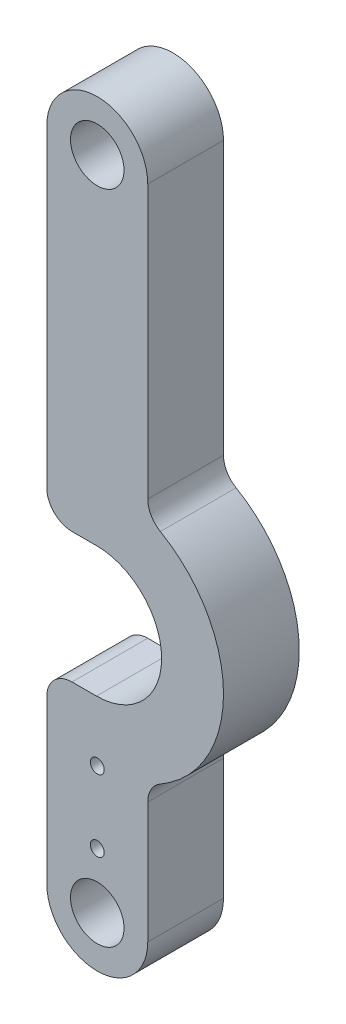
ISO-10303-21;
HEADER;
FILE_DESCRIPTION(('STEP AP214'),'2;1');
FILE_NAME('part.step','',(''),(''),'','','');
FILE_SCHEMA(('AUTOMOTIVE_DESIGN { 1 0 10303 214 1 1 1 1 }'));
ENDSEC;
DATA;
#1=APPLICATION_CONTEXT('core data for automotive mechanical design processes');
#2=APPLICATION_PROTOCOL_DEFINITION('international standard','automotive_design',2000,#1);
#3=PRODUCT_CONTEXT('',#1,'mechanical');
#4=PRODUCT('Part','Part','',(#3));
#5=PRODUCT_RELATED_PRODUCT_CATEGORY('part','',(#4));
#6=PRODUCT_DEFINITION_FORMATION('','',#4);
#7=PRODUCT_DEFINITION_CONTEXT('part definition',#1,'design');
#8=PRODUCT_DEFINITION('design','',#6,#7);
#9=PRODUCT_DEFINITION_SHAPE('','',#8);
#10=(LENGTH_UNIT() NAMED_UNIT(*) SI_UNIT(.MILLI.,.METRE.));
#11=(NAMED_UNIT(*) PLANE_ANGLE_UNIT() SI_UNIT($,.RADIAN.));
#12=(NAMED_UNIT(*) SI_UNIT($,.STERADIAN.) SOLID_ANGLE_UNIT());
#13=UNCERTAINTY_MEASURE_WITH_UNIT(LENGTH_MEASURE(1.E-05),#10,'distance_accuracy_value','');
#14=(GEOMETRIC_REPRESENTATION_CONTEXT(3) GLOBAL_UNCERTAINTY_ASSIGNED_CONTEXT((#13)) GLOBAL_UNIT_ASSIGNED_CONTEXT((#10,
#11,#12)) REPRESENTATION_CONTEXT('',''));
#15=CARTESIAN_POINT('',(0.,0.,0.));
#16=DIRECTION('',(0.,0.,1.));
#17=DIRECTION('',(1.,0.,0.));
#18=AXIS2_PLACEMENT_3D('',#15,#16,#17);
#19=CARTESIAN_POINT('',(-6.35,0.,9.525));
#20=DIRECTION('',(1.,0.,0.));
#21=DIRECTION('',(0.,0.,-1.));
#22=AXIS2_PLACEMENT_3D('',#19,#20,#21);
#23=PLANE('',#22);
#24=DIRECTION('',(0.,-1.,0.));
#25=VECTOR('',#24,1.);
#26=CARTESIAN_POINT('',(-6.35,0.,9.525));
#27=LINE('',#26,#25);
#28=CARTESIAN_POINT('',(-6.35,20.3835,9.525));
#29=VERTEX_POINT('',#28);
#30=CARTESIAN_POINT('',(-6.35,0.,9.525));
#31=VERTEX_POINT('',#30);
#32=EDGE_CURVE('E214',#29,#31,#27,.T.);
#33=ORIENTED_EDGE('',*,*,#32,.F.);
#34=DIRECTION('',(0.,0.,1.));
#35=VECTOR('',#34,1.);
#36=CARTESIAN_POINT('',(-6.35,20.3835,9.525));
#37=LINE('',#36,#35);
#38=CARTESIAN_POINT('',(-6.35,20.3835,0.));
#39=VERTEX_POINT('',#38);
#40=EDGE_CURVE('E247',#29,#39,#37,.F.);
#41=ORIENTED_EDGE('',*,*,#40,.T.);
#42=DIRECTION('',(0.,-1.,0.));
#43=VECTOR('',#42,1.);
#44=CARTESIAN_POINT('',(-6.35,0.,0.));
#45=LINE('',#44,#43);
#46=CARTESIAN_POINT('',(-6.35,0.,0.));
#47=VERTEX_POINT('',#46);
#48=EDGE_CURVE('E226',#39,#47,#45,.T.);
#49=ORIENTED_EDGE('',*,*,#48,.T.);
#50=DIRECTION('',(0.,0.,-1.));
#51=VECTOR('',#50,1.);
#52=CARTESIAN_POINT('',(-6.35,0.,9.525));
#53=LINE('',#52,#51);
#54=EDGE_CURVE('E218',#31,#47,#53,.T.);
#55=ORIENTED_EDGE('',*,*,#54,.F.);
#56=EDGE_LOOP('',(#33,#41,#49,#55));
#57=FACE_BOUND('',#56,.T.);
#58=ADVANCED_FACE('F39',(#57),#23,.F.);
#59=CARTESIAN_POINT('',(6.35,0.,9.525));
#60=DIRECTION('',(-1.,0.,0.));
#61=DIRECTION('',(0.,0.,1.));
#62=AXIS2_PLACEMENT_3D('',#59,#60,#61);
#63=PLANE('',#62);
#64=DIRECTION('',(0.,1.,0.));
#65=VECTOR('',#64,1.);
#66=CARTESIAN_POINT('',(6.35,0.,0.));
#67=LINE('',#66,#65);
#68=CARTESIAN_POINT('',(6.35,0.,0.));
#69=VERTEX_POINT('',#68);
#70=CARTESIAN_POINT('',(6.35,15.2522160579064,0.));
#71=VERTEX_POINT('',#70);
#72=EDGE_CURVE('E222',#69,#71,#67,.T.);
#73=ORIENTED_EDGE('',*,*,#72,.T.);
#74=DIRECTION('',(0.,0.,1.));
#75=VECTOR('',#74,1.);
#76=CARTESIAN_POINT('',(6.35,15.2522160579064,9.525));
#77=LINE('',#76,#75);
#78=CARTESIAN_POINT('',(6.35,15.2522160579064,9.525));
#79=VERTEX_POINT('',#78);
#80=EDGE_CURVE('E264',#71,#79,#77,.T.);
#81=ORIENTED_EDGE('',*,*,#80,.T.);
#82=DIRECTION('',(0.,1.,0.));
#83=VECTOR('',#82,1.);
#84=CARTESIAN_POINT('',(6.35,0.,9.525));
#85=LINE('',#84,#83);
#86=CARTESIAN_POINT('',(6.35,0.,9.525));
#87=VERTEX_POINT('',#86);
#88=EDGE_CURVE('E209',#87,#79,#85,.T.);
#89=ORIENTED_EDGE('',*,*,#88,.F.);
#90=DIRECTION('',(0.,0.,-1.));
#91=VECTOR('',#90,1.);
#92=CARTESIAN_POINT('',(6.35,0.,9.525));
#93=LINE('',#92,#91);
#94=EDGE_CURVE('E237',#87,#69,#93,.T.);
#95=ORIENTED_EDGE('',*,*,#94,.T.);
#96=EDGE_LOOP('',(#73,#81,#89,#95));
#97=FACE_BOUND('',#96,.T.);
#98=ADVANCED_FACE('F279',(#97),#63,.F.);
#99=CARTESIAN_POINT('',(0.,0.,9.525));
#100=DIRECTION('',(0.,0.,1.));
#101=DIRECTION('',(1.,0.,0.));
#102=AXIS2_PLACEMENT_3D('',#99,#100,#101);
#103=PLANE('',#102);
#104=DIRECTION('',(1.,0.,0.));
#105=VECTOR('',#104,1.);
#106=CARTESIAN_POINT('',(-0.0968086729051788,23.5585,9.525));
#107=LINE('',#106,#105);
#108=CARTESIAN_POINT('',(-3.175,23.5585,9.525));
#109=VERTEX_POINT('',#108);
#110=CARTESIAN_POINT('',(-0.0968086729051788,23.5585,9.525));
#111=VERTEX_POINT('',#110);
#112=EDGE_CURVE('E165',#109,#111,#107,.T.);
#113=ORIENTED_EDGE('',*,*,#112,.F.);
#114=CARTESIAN_POINT('',(-3.175,20.3835,9.525));
#115=DIRECTION('',(0.,0.,1.));
#116=DIRECTION('',(1.,0.,0.));
#117=AXIS2_PLACEMENT_3D('',#114,#115,#116);
#118=CIRCLE('',#117,3.175);
#119=EDGE_CURVE('E245',#109,#29,#118,.T.);
#120=ORIENTED_EDGE('',*,*,#119,.T.);
#121=ORIENTED_EDGE('',*,*,#32,.T.);
#122=CARTESIAN_POINT('',(0.,0.,9.525));
#123=DIRECTION('',(0.,0.,1.));
#124=DIRECTION('',(1.,0.,0.));
#125=AXIS2_PLACEMENT_3D('',#122,#123,#124);
#126=CIRCLE('',#125,6.35);
#127=EDGE_CURVE('E204',#31,#87,#126,.T.);
#128=ORIENTED_EDGE('',*,*,#127,.T.);
#129=ORIENTED_EDGE('',*,*,#88,.T.);
#130=CARTESIAN_POINT('',(9.525,15.2522160579064,9.525));
#131=DIRECTION('',(0.,0.,1.));
#132=DIRECTION('',(1.,0.,0.));
#133=AXIS2_PLACEMENT_3D('',#130,#131,#132);
#134=CIRCLE('',#133,3.175);
#135=CARTESIAN_POINT('',(7.9375,18.001846714922,9.525));
#136=VERTEX_POINT('',#135);
#137=EDGE_CURVE('E47',#79,#136,#134,.F.);
#138=ORIENTED_EDGE('',*,*,#137,.T.);
#139=CARTESIAN_POINT('',(0.,31.75,9.525));
#140=DIRECTION('',(0.,0.,1.));
#141=DIRECTION('',(-1.,0.,0.));
#142=AXIS2_PLACEMENT_3D('',#139,#140,#141);
#143=CIRCLE('',#142,15.875);
#144=CARTESIAN_POINT('',(7.9375,45.498153285078,9.525));
#145=VERTEX_POINT('',#144);
#146=EDGE_CURVE('E173',#136,#145,#143,.T.);
#147=ORIENTED_EDGE('',*,*,#146,.T.);
#148=CARTESIAN_POINT('',(9.525,48.2477839420936,9.525));
#149=DIRECTION('',(0.,0.,1.));
#150=DIRECTION('',(1.,0.,0.));
#151=AXIS2_PLACEMENT_3D('',#148,#149,#150);
#152=CIRCLE('',#151,3.175);
#153=CARTESIAN_POINT('',(6.35,48.2477839420936,9.525));
#154=VERTEX_POINT('',#153);
#155=EDGE_CURVE('E266',#145,#154,#152,.F.);
#156=ORIENTED_EDGE('',*,*,#155,.T.);
#157=CARTESIAN_POINT('',(6.35,82.55,9.525));
#158=VERTEX_POINT('',#157);
#159=EDGE_CURVE('E207',#154,#158,#85,.T.);
#160=ORIENTED_EDGE('',*,*,#159,.T.);
#161=CARTESIAN_POINT('',(0.,82.55,9.525));
#162=DIRECTION('',(0.,0.,1.));
#163=DIRECTION('',(1.,0.,0.));
#164=AXIS2_PLACEMENT_3D('',#161,#162,#163);
#165=CIRCLE('',#164,6.35);
#166=CARTESIAN_POINT('',(-6.35,82.55,9.525));
#167=VERTEX_POINT('',#166);
#168=EDGE_CURVE('E212',#158,#167,#165,.T.);
#169=ORIENTED_EDGE('',*,*,#168,.T.);
#170=CARTESIAN_POINT('',(-6.35,43.1165,9.525));
#171=VERTEX_POINT('',#170);
#172=EDGE_CURVE('E215',#167,#171,#27,.T.);
#173=ORIENTED_EDGE('',*,*,#172,.T.);
#174=CARTESIAN_POINT('',(-3.175,43.1165,9.525));
#175=DIRECTION('',(0.,0.,1.));
#176=DIRECTION('',(1.,0.,0.));
#177=AXIS2_PLACEMENT_3D('',#174,#175,#176);
#178=CIRCLE('',#177,3.175);
#179=CARTESIAN_POINT('',(-3.175,39.9415,9.525));
#180=VERTEX_POINT('',#179);
#181=EDGE_CURVE('E243',#171,#180,#178,.T.);
#182=ORIENTED_EDGE('',*,*,#181,.T.);
#183=DIRECTION('',(-1.,0.,0.));
#184=VECTOR('',#183,1.);
#185=CARTESIAN_POINT('',(-0.0968086729051808,39.9415,9.525));
#186=LINE('',#185,#184);
#187=CARTESIAN_POINT('',(-0.0968086729051808,39.9415,9.525));
#188=VERTEX_POINT('',#187);
#189=EDGE_CURVE('E167',#188,#180,#186,.T.);
#190=ORIENTED_EDGE('',*,*,#189,.F.);
#191=CARTESIAN_POINT('',(-0.0968086729051798,31.75,9.525));
#192=DIRECTION('',(0.,0.,1.));
#193=DIRECTION('',(1.,0.,0.));
#194=AXIS2_PLACEMENT_3D('',#191,#192,#193);
#195=CIRCLE('',#194,8.19149999999999);
#196=EDGE_CURVE('E146',#111,#188,#195,.T.);
#197=ORIENTED_EDGE('',*,*,#196,.F.);
#198=EDGE_LOOP('',(#113,#120,#121,#128,#129,#138,#147,#156,#160,#169,#173,#182,#190,#197));
#199=FACE_BOUND('',#198,.T.);
#200=CARTESIAN_POINT('',(0.,6.99999997,9.525));
#201=DIRECTION('',(0.,0.,1.));
#202=DIRECTION('',(1.,0.,0.));
#203=AXIS2_PLACEMENT_3D('',#200,#201,#202);
#204=CIRCLE('',#203,0.877000024);
#205=CARTESIAN_POINT('',(0.877000024,6.99999997,9.525));
#206=VERTEX_POINT('',#205);
#207=EDGE_CURVE('E184',#206,#206,#204,.T.);
#208=ORIENTED_EDGE('',*,*,#207,.F.);
#209=EDGE_LOOP('',(#208));
#210=FACE_BOUND('',#209,.T.);
#211=CARTESIAN_POINT('',(0.,16.000000004,9.525));
#212=DIRECTION('',(0.,0.,1.));
#213=DIRECTION('',(1.,0.,0.));
#214=AXIS2_PLACEMENT_3D('',#211,#212,#213);
#215=CIRCLE('',#214,0.877000024);
#216=CARTESIAN_POINT('',(0.877000024,16.000000004,9.525));
#217=VERTEX_POINT('',#216);
#218=EDGE_CURVE('E187',#217,#217,#215,.T.);
#219=ORIENTED_EDGE('',*,*,#218,.F.);
#220=EDGE_LOOP('',(#219));
#221=FACE_BOUND('',#220,.T.);
#222=CARTESIAN_POINT('',(0.,82.55,9.525));
#223=DIRECTION('',(0.,0.,1.));
#224=DIRECTION('',(1.,0.,0.));
#225=AXIS2_PLACEMENT_3D('',#222,#223,#224);
#226=CIRCLE('',#225,3.36549999999999);
#227=CARTESIAN_POINT('',(-3.36549999999999,82.55,9.525));
#228=VERTEX_POINT('',#227);
#229=EDGE_CURVE('E198',#228,#228,#226,.T.);
#230=ORIENTED_EDGE('',*,*,#229,.F.);
#231=EDGE_LOOP('',(#230));
#232=FACE_BOUND('',#231,.T.);
#233=CARTESIAN_POINT('',(0.,0.,9.525));
#234=DIRECTION('',(0.,0.,1.));
#235=DIRECTION('',(1.,0.,0.));
#236=AXIS2_PLACEMENT_3D('',#233,#234,#235);
#237=CIRCLE('',#236,3.3655);
#238=CARTESIAN_POINT('',(-3.3655,0.,9.525));
#239=VERTEX_POINT('',#238);
#240=EDGE_CURVE('E192',#239,#239,#237,.T.);
#241=ORIENTED_EDGE('',*,*,#240,.F.);
#242=EDGE_LOOP('',(#241));
#243=FACE_BOUND('',#242,.T.);
#244=ADVANCED_FACE('F272',(#199,#210,#221,#232,#243),#103,.T.);
#245=CARTESIAN_POINT('',(0.,0.,0.));
#246=DIRECTION('',(0.,0.,1.));
#247=DIRECTION('',(1.,0.,0.));
#248=AXIS2_PLACEMENT_3D('',#245,#246,#247);
#249=PLANE('',#248);
#250=CARTESIAN_POINT('',(0.,6.99999997,0.));
#251=DIRECTION('',(0.,0.,1.));
#252=DIRECTION('',(1.,0.,0.));
#253=AXIS2_PLACEMENT_3D('',#250,#251,#252);
#254=CIRCLE('',#253,0.877000024);
#255=CARTESIAN_POINT('',(0.877000024,6.99999997,0.));
#256=VERTEX_POINT('',#255);
#257=EDGE_CURVE('E180',#256,#256,#254,.T.);
#258=ORIENTED_EDGE('',*,*,#257,.T.);
#259=EDGE_LOOP('',(#258));
#260=FACE_BOUND('',#259,.T.);
#261=CARTESIAN_POINT('',(0.,16.000000004,0.));
#262=DIRECTION('',(0.,0.,1.));
#263=DIRECTION('',(1.,0.,0.));
#264=AXIS2_PLACEMENT_3D('',#261,#262,#263);
#265=CIRCLE('',#264,0.877000024);
#266=CARTESIAN_POINT('',(0.877000024,16.000000004,0.));
#267=VERTEX_POINT('',#266);
#268=EDGE_CURVE('E177',#267,#267,#265,.T.);
#269=ORIENTED_EDGE('',*,*,#268,.T.);
#270=EDGE_LOOP('',(#269));
#271=FACE_BOUND('',#270,.T.);
#272=ORIENTED_EDGE('',*,*,#48,.F.);
#273=CARTESIAN_POINT('',(-3.175,20.3835,0.));
#274=DIRECTION('',(0.,0.,1.));
#275=DIRECTION('',(1.,0.,0.));
#276=AXIS2_PLACEMENT_3D('',#273,#274,#275);
#277=CIRCLE('',#276,3.175);
#278=CARTESIAN_POINT('',(-3.175,23.5585,0.));
#279=VERTEX_POINT('',#278);
#280=EDGE_CURVE('E251',#39,#279,#277,.F.);
#281=ORIENTED_EDGE('',*,*,#280,.T.);
#282=DIRECTION('',(1.,0.,0.));
#283=VECTOR('',#282,1.);
#284=CARTESIAN_POINT('',(-0.0968086729051788,23.5585,0.));
#285=LINE('',#284,#283);
#286=CARTESIAN_POINT('',(-0.0968086729051788,23.5585,0.));
#287=VERTEX_POINT('',#286);
#288=EDGE_CURVE('E151',#279,#287,#285,.T.);
#289=ORIENTED_EDGE('',*,*,#288,.T.);
#290=CARTESIAN_POINT('',(-0.0968086729051798,31.75,0.));
#291=DIRECTION('',(0.,0.,1.));
#292=DIRECTION('',(1.,0.,0.));
#293=AXIS2_PLACEMENT_3D('',#290,#291,#292);
#294=CIRCLE('',#293,8.19149999999999);
#295=CARTESIAN_POINT('',(-0.0968086729051808,39.9415,0.));
#296=VERTEX_POINT('',#295);
#297=EDGE_CURVE('E144',#287,#296,#294,.T.);
#298=ORIENTED_EDGE('',*,*,#297,.T.);
#299=DIRECTION('',(-1.,0.,0.));
#300=VECTOR('',#299,1.);
#301=CARTESIAN_POINT('',(-0.0968086729051808,39.9415,0.));
#302=LINE('',#301,#300);
#303=CARTESIAN_POINT('',(-3.175,39.9415,0.));
#304=VERTEX_POINT('',#303);
#305=EDGE_CURVE('E154',#296,#304,#302,.T.);
#306=ORIENTED_EDGE('',*,*,#305,.T.);
#307=CARTESIAN_POINT('',(-3.175,43.1165,0.));
#308=DIRECTION('',(0.,0.,1.));
#309=DIRECTION('',(1.,0.,0.));
#310=AXIS2_PLACEMENT_3D('',#307,#308,#309);
#311=CIRCLE('',#310,3.175);
#312=CARTESIAN_POINT('',(-6.35,43.1165,0.));
#313=VERTEX_POINT('',#312);
#314=EDGE_CURVE('E249',#304,#313,#311,.F.);
#315=ORIENTED_EDGE('',*,*,#314,.T.);
#316=CARTESIAN_POINT('',(-6.35,82.55,0.));
#317=VERTEX_POINT('',#316);
#318=EDGE_CURVE('E208',#317,#313,#45,.T.);
#319=ORIENTED_EDGE('',*,*,#318,.F.);
#320=CARTESIAN_POINT('',(0.,82.55,0.));
#321=DIRECTION('',(0.,0.,1.));
#322=DIRECTION('',(1.,0.,0.));
#323=AXIS2_PLACEMENT_3D('',#320,#321,#322);
#324=CIRCLE('',#323,6.35);
#325=CARTESIAN_POINT('',(6.35,82.55,0.));
#326=VERTEX_POINT('',#325);
#327=EDGE_CURVE('E224',#326,#317,#324,.T.);
#328=ORIENTED_EDGE('',*,*,#327,.F.);
#329=CARTESIAN_POINT('',(6.35,48.2477839420936,0.));
#330=VERTEX_POINT('',#329);
#331=EDGE_CURVE('E221',#330,#326,#67,.T.);
#332=ORIENTED_EDGE('',*,*,#331,.F.);
#333=CARTESIAN_POINT('',(9.525,48.2477839420936,0.));
#334=DIRECTION('',(0.,0.,1.));
#335=DIRECTION('',(1.,0.,0.));
#336=AXIS2_PLACEMENT_3D('',#333,#334,#335);
#337=CIRCLE('',#336,3.175);
#338=CARTESIAN_POINT('',(7.9375,45.498153285078,0.));
#339=VERTEX_POINT('',#338);
#340=EDGE_CURVE('E268',#330,#339,#337,.T.);
#341=ORIENTED_EDGE('',*,*,#340,.T.);
#342=CARTESIAN_POINT('',(0.,31.75,0.));
#343=DIRECTION('',(0.,0.,1.));
#344=DIRECTION('',(1.,0.,0.));
#345=AXIS2_PLACEMENT_3D('',#342,#343,#344);
#346=CIRCLE('',#345,15.875);
#347=CARTESIAN_POINT('',(7.9375,18.001846714922,0.));
#348=VERTEX_POINT('',#347);
#349=EDGE_CURVE('E175',#339,#348,#346,.F.);
#350=ORIENTED_EDGE('',*,*,#349,.T.);
#351=CARTESIAN_POINT('',(9.525,15.2522160579064,0.));
#352=DIRECTION('',(0.,0.,1.));
#353=DIRECTION('',(1.,0.,0.));
#354=AXIS2_PLACEMENT_3D('',#351,#352,#353);
#355=CIRCLE('',#354,3.175);
#356=EDGE_CURVE('E11',#348,#71,#355,.T.);
#357=ORIENTED_EDGE('',*,*,#356,.T.);
#358=ORIENTED_EDGE('',*,*,#72,.F.);
#359=CARTESIAN_POINT('',(0.,0.,0.));
#360=DIRECTION('',(0.,0.,1.));
#361=DIRECTION('',(1.,0.,0.));
#362=AXIS2_PLACEMENT_3D('',#359,#360,#361);
#363=CIRCLE('',#362,6.35);
#364=EDGE_CURVE('E201',#47,#69,#363,.T.);
#365=ORIENTED_EDGE('',*,*,#364,.F.);
#366=EDGE_LOOP('',(#272,#281,#289,#298,#306,#315,#319,#328,#332,#341,#350,#357,#358,#365));
#367=FACE_BOUND('',#366,.T.);
#368=CARTESIAN_POINT('',(0.,82.55,0.));
#369=DIRECTION('',(0.,0.,1.));
#370=DIRECTION('',(1.,0.,0.));
#371=AXIS2_PLACEMENT_3D('',#368,#369,#370);
#372=CIRCLE('',#371,3.36549999999999);
#373=CARTESIAN_POINT('',(-3.36549999999999,82.55,0.));
#374=VERTEX_POINT('',#373);
#375=EDGE_CURVE('E195',#374,#374,#372,.T.);
#376=ORIENTED_EDGE('',*,*,#375,.T.);
#377=EDGE_LOOP('',(#376));
#378=FACE_BOUND('',#377,.T.);
#379=CARTESIAN_POINT('',(0.,0.,0.));
#380=DIRECTION('',(0.,0.,1.));
#381=DIRECTION('',(1.,0.,0.));
#382=AXIS2_PLACEMENT_3D('',#379,#380,#381);
#383=CIRCLE('',#382,3.3655);
#384=CARTESIAN_POINT('',(-3.3655,0.,0.));
#385=VERTEX_POINT('',#384);
#386=EDGE_CURVE('E183',#385,#385,#383,.T.);
#387=ORIENTED_EDGE('',*,*,#386,.T.);
#388=EDGE_LOOP('',(#387));
#389=FACE_BOUND('',#388,.T.);
#390=ADVANCED_FACE('F161',(#260,#271,#367,#378,#389),#249,.F.);
#391=CARTESIAN_POINT('',(0.,0.,9.525));
#392=DIRECTION('',(0.,0.,-1.));
#393=DIRECTION('',(-1.,0.,0.));
#394=AXIS2_PLACEMENT_3D('',#391,#392,#393);
#395=CYLINDRICAL_SURFACE('',#394,6.35);
#396=ORIENTED_EDGE('',*,*,#364,.T.);
#397=ORIENTED_EDGE('',*,*,#94,.F.);
#398=ORIENTED_EDGE('',*,*,#127,.F.);
#399=ORIENTED_EDGE('',*,*,#54,.T.);
#400=EDGE_LOOP('',(#396,#397,#398,#399));
#401=FACE_BOUND('',#400,.T.);
#402=ADVANCED_FACE('F284',(#401),#395,.T.);
#403=ORIENTED_EDGE('',*,*,#159,.F.);
#404=DIRECTION('',(0.,0.,1.));
#405=VECTOR('',#404,1.);
#406=CARTESIAN_POINT('',(6.35,48.2477839420936,9.525));
#407=LINE('',#406,#405);
#408=EDGE_CURVE('E262',#154,#330,#407,.F.);
#409=ORIENTED_EDGE('',*,*,#408,.T.);
#410=ORIENTED_EDGE('',*,*,#331,.T.);
#411=DIRECTION('',(0.,0.,-1.));
#412=VECTOR('',#411,1.);
#413=CARTESIAN_POINT('',(6.35,82.55,9.525));
#414=LINE('',#413,#412);
#415=EDGE_CURVE('E234',#158,#326,#414,.T.);
#416=ORIENTED_EDGE('',*,*,#415,.F.);
#417=EDGE_LOOP('',(#403,#409,#410,#416));
#418=FACE_BOUND('',#417,.T.);
#419=ADVANCED_FACE('F315',(#418),#63,.F.);
#420=CARTESIAN_POINT('',(0.,82.55,9.525));
#421=DIRECTION('',(0.,0.,-1.));
#422=DIRECTION('',(-1.,0.,0.));
#423=AXIS2_PLACEMENT_3D('',#420,#421,#422);
#424=CYLINDRICAL_SURFACE('',#423,6.35);
#425=ORIENTED_EDGE('',*,*,#327,.T.);
#426=DIRECTION('',(0.,0.,-1.));
#427=VECTOR('',#426,1.);
#428=CARTESIAN_POINT('',(-6.35,82.55,9.525));
#429=LINE('',#428,#427);
#430=EDGE_CURVE('E231',#167,#317,#429,.T.);
#431=ORIENTED_EDGE('',*,*,#430,.F.);
#432=ORIENTED_EDGE('',*,*,#168,.F.);
#433=ORIENTED_EDGE('',*,*,#415,.T.);
#434=EDGE_LOOP('',(#425,#431,#432,#433));
#435=FACE_BOUND('',#434,.T.);
#436=ADVANCED_FACE('F306',(#435),#424,.T.);
#437=ORIENTED_EDGE('',*,*,#318,.T.);
#438=DIRECTION('',(0.,0.,1.));
#439=VECTOR('',#438,1.);
#440=CARTESIAN_POINT('',(-6.35,43.1165,9.525));
#441=LINE('',#440,#439);
#442=EDGE_CURVE('E253',#313,#171,#441,.T.);
#443=ORIENTED_EDGE('',*,*,#442,.T.);
#444=ORIENTED_EDGE('',*,*,#172,.F.);
#445=ORIENTED_EDGE('',*,*,#430,.T.);
#446=EDGE_LOOP('',(#437,#443,#444,#445));
#447=FACE_BOUND('',#446,.T.);
#448=ADVANCED_FACE('F301',(#447),#23,.F.);
#449=CARTESIAN_POINT('',(0.,82.55,9.525));
#450=DIRECTION('',(0.,0.,-1.));
#451=DIRECTION('',(-1.,0.,0.));
#452=AXIS2_PLACEMENT_3D('',#449,#450,#451);
#453=CYLINDRICAL_SURFACE('',#452,3.36549999999999);
#454=CARTESIAN_POINT('',(-3.36549999999999,82.55,9.525));
#455=CARTESIAN_POINT('',(-3.36549999999999,82.55,9.42578125));
#456=CARTESIAN_POINT('',(-3.36549999999999,82.55,9.3265625));
#457=CARTESIAN_POINT('',(-3.36549999999999,82.55,9.128125));
#458=CARTESIAN_POINT('',(-3.36549999999999,82.55,9.02890625));
#459=CARTESIAN_POINT('',(-3.36549999999999,82.55,8.83046875));
#460=CARTESIAN_POINT('',(-3.36549999999999,82.55,8.73125));
#461=CARTESIAN_POINT('',(-3.36549999999999,82.55,8.5328125));
#462=CARTESIAN_POINT('',(-3.36549999999999,82.55,8.43359375));
#463=CARTESIAN_POINT('',(-3.36549999999999,82.55,8.23515625));
#464=CARTESIAN_POINT('',(-3.36549999999999,82.55,8.1359375));
#465=CARTESIAN_POINT('',(-3.36549999999999,82.55,7.9375));
#466=CARTESIAN_POINT('',(-3.36549999999999,82.55,7.83828125));
#467=CARTESIAN_POINT('',(-3.36549999999999,82.55,7.63984375));
#468=CARTESIAN_POINT('',(-3.36549999999999,82.55,7.540625));
#469=CARTESIAN_POINT('',(-3.36549999999999,82.55,7.3421875));
#470=CARTESIAN_POINT('',(-3.36549999999999,82.55,7.24296875));
#471=CARTESIAN_POINT('',(-3.36549999999999,82.55,7.04453125));
#472=CARTESIAN_POINT('',(-3.36549999999999,82.55,6.9453125));
#473=CARTESIAN_POINT('',(-3.36549999999999,82.55,6.746875));
#474=CARTESIAN_POINT('',(-3.36549999999999,82.55,6.64765625));
#475=CARTESIAN_POINT('',(-3.36549999999999,82.55,6.44921875));
#476=CARTESIAN_POINT('',(-3.36549999999999,82.55,6.35));
#477=CARTESIAN_POINT('',(-3.36549999999999,82.55,6.1515625));
#478=CARTESIAN_POINT('',(-3.36549999999999,82.55,6.05234375));
#479=CARTESIAN_POINT('',(-3.36549999999999,82.55,5.85390625));
#480=CARTESIAN_POINT('',(-3.36549999999999,82.55,5.7546875));
#481=CARTESIAN_POINT('',(-3.36549999999999,82.55,5.55625));
#482=CARTESIAN_POINT('',(-3.36549999999999,82.55,5.45703125));
#483=CARTESIAN_POINT('',(-3.36549999999999,82.55,5.25859375));
#484=CARTESIAN_POINT('',(-3.36549999999999,82.55,5.159375));
#485=CARTESIAN_POINT('',(-3.36549999999999,82.55,4.9609375));
#486=CARTESIAN_POINT('',(-3.36549999999999,82.55,4.86171875));
#487=CARTESIAN_POINT('',(-3.36549999999999,82.55,4.66328125));
#488=CARTESIAN_POINT('',(-3.36549999999999,82.55,4.5640625));
#489=CARTESIAN_POINT('',(-3.36549999999999,82.55,4.365625));
#490=CARTESIAN_POINT('',(-3.36549999999999,82.55,4.26640625));
#491=CARTESIAN_POINT('',(-3.36549999999999,82.55,4.06796875));
#492=CARTESIAN_POINT('',(-3.36549999999999,82.55,3.96875));
#493=CARTESIAN_POINT('',(-3.36549999999999,82.55,3.7703125));
#494=CARTESIAN_POINT('',(-3.36549999999999,82.55,3.67109375));
#495=CARTESIAN_POINT('',(-3.36549999999999,82.55,3.47265625));
#496=CARTESIAN_POINT('',(-3.36549999999999,82.55,3.3734375));
#497=CARTESIAN_POINT('',(-3.36549999999999,82.55,3.175));
#498=CARTESIAN_POINT('',(-3.36549999999999,82.55,3.07578125));
#499=CARTESIAN_POINT('',(-3.36549999999999,82.55,2.87734375));
#500=CARTESIAN_POINT('',(-3.36549999999999,82.55,2.778125));
#501=CARTESIAN_POINT('',(-3.36549999999999,82.55,2.5796875));
#502=CARTESIAN_POINT('',(-3.36549999999999,82.55,2.48046875));
#503=CARTESIAN_POINT('',(-3.36549999999999,82.55,2.28203125));
#504=CARTESIAN_POINT('',(-3.36549999999999,82.55,2.1828125));
#505=CARTESIAN_POINT('',(-3.36549999999999,82.55,1.984375));
#506=CARTESIAN_POINT('',(-3.36549999999999,82.55,1.88515625));
#507=CARTESIAN_POINT('',(-3.36549999999999,82.55,1.68671875));
#508=CARTESIAN_POINT('',(-3.36549999999999,82.55,1.5875));
#509=CARTESIAN_POINT('',(-3.36549999999999,82.55,1.3890625));
#510=CARTESIAN_POINT('',(-3.36549999999999,82.55,1.28984375));
#511=CARTESIAN_POINT('',(-3.36549999999999,82.55,1.09140625));
#512=CARTESIAN_POINT('',(-3.36549999999999,82.55,0.992187500000001));
#513=CARTESIAN_POINT('',(-3.36549999999999,82.55,0.793750000000001));
#514=CARTESIAN_POINT('',(-3.36549999999999,82.55,0.69453125));
#515=CARTESIAN_POINT('',(-3.36549999999999,82.55,0.49609375));
#516=CARTESIAN_POINT('',(-3.36549999999999,82.55,0.396875));
#517=CARTESIAN_POINT('',(-3.36549999999999,82.55,0.1984375));
#518=CARTESIAN_POINT('',(-3.36549999999999,82.55,0.0992187500000001));
#519=CARTESIAN_POINT('',(-3.36549999999999,82.55,0.));
#520=B_SPLINE_CURVE_WITH_KNOTS('',3,(#454,#455,#456,#457,#458,#459,#460,#461,#462,#463,#464,
#465,#466,#467,#468,#469,#470,#471,#472,#473,#474,#475,#476,#477,#478,#479,#480,#481,#482,#483,
#484,#485,#486,#487,#488,#489,#490,#491,#492,#493,#494,#495,#496,#497,#498,#499,#500,#501,#502,
#503,#504,#505,#506,#507,#508,#509,#510,#511,#512,#513,#514,#515,#516,#517,#518,#519),
.UNSPECIFIED.,.F.,.F.,(4,2,2,2,2,2,2,2,2,2,2,2,2,2,2,2,2,2,2,2,2,2,2,2,2,2,2,2,2,2,2,2,4),(0.,
0.29765625,0.5953125,0.892968750000001,1.190625,1.48828125,1.7859375,2.08359375,2.38125,
2.67890625,2.9765625,3.27421875,3.571875,3.86953125,4.1671875,4.46484375,4.7625,5.06015625,
5.3578125,5.65546875,5.953125,6.25078125,6.5484375,6.84609375,7.14375,7.44140625,7.7390625,
8.03671875,8.334375,8.63203125,8.9296875,9.22734375,9.525),.UNSPECIFIED.);
#521=EDGE_CURVE('BSEAM331',#228,#374,#520,.T.);
#522=ORIENTED_EDGE('',*,*,#229,.T.);
#523=ORIENTED_EDGE('',*,*,#375,.F.);
#524=ORIENTED_EDGE('',*,*,#521,.T.);
#525=ORIENTED_EDGE('',*,*,#521,.F.);
#526=EDGE_LOOP('',(#522,#524,#523,#525));
#527=FACE_BOUND('',#526,.T.);
#528=ADVANCED_FACE('F331',(#527),#453,.F.);
#529=CARTESIAN_POINT('',(0.,0.,9.525));
#530=DIRECTION('',(0.,0.,-1.));
#531=DIRECTION('',(-1.,0.,0.));
#532=AXIS2_PLACEMENT_3D('',#529,#530,#531);
#533=CYLINDRICAL_SURFACE('',#532,3.3655);
#534=CARTESIAN_POINT('',(-3.3655,0.,9.525));
#535=CARTESIAN_POINT('',(-3.3655,0.,9.42578125));
#536=CARTESIAN_POINT('',(-3.3655,0.,9.3265625));
#537=CARTESIAN_POINT('',(-3.3655,0.,9.128125));
#538=CARTESIAN_POINT('',(-3.3655,0.,9.02890625));
#539=CARTESIAN_POINT('',(-3.3655,0.,8.83046875));
#540=CARTESIAN_POINT('',(-3.3655,0.,8.73125));
#541=CARTESIAN_POINT('',(-3.3655,0.,8.5328125));
#542=CARTESIAN_POINT('',(-3.3655,0.,8.43359375));
#543=CARTESIAN_POINT('',(-3.3655,0.,8.23515625));
#544=CARTESIAN_POINT('',(-3.3655,0.,8.1359375));
#545=CARTESIAN_POINT('',(-3.3655,0.,7.9375));
#546=CARTESIAN_POINT('',(-3.3655,0.,7.83828125));
#547=CARTESIAN_POINT('',(-3.3655,0.,7.63984375));
#548=CARTESIAN_POINT('',(-3.3655,0.,7.540625));
#549=CARTESIAN_POINT('',(-3.3655,0.,7.3421875));
#550=CARTESIAN_POINT('',(-3.3655,0.,7.24296875));
#551=CARTESIAN_POINT('',(-3.3655,0.,7.04453125));
#552=CARTESIAN_POINT('',(-3.3655,0.,6.9453125));
#553=CARTESIAN_POINT('',(-3.3655,0.,6.746875));
#554=CARTESIAN_POINT('',(-3.3655,0.,6.64765625));
#555=CARTESIAN_POINT('',(-3.3655,0.,6.44921875));
#556=CARTESIAN_POINT('',(-3.3655,0.,6.35));
#557=CARTESIAN_POINT('',(-3.3655,0.,6.1515625));
#558=CARTESIAN_POINT('',(-3.3655,0.,6.05234375));
#559=CARTESIAN_POINT('',(-3.3655,0.,5.85390625));
#560=CARTESIAN_POINT('',(-3.3655,0.,5.7546875));
#561=CARTESIAN_POINT('',(-3.3655,0.,5.55625));
#562=CARTESIAN_POINT('',(-3.3655,0.,5.45703125));
#563=CARTESIAN_POINT('',(-3.3655,0.,5.25859375));
#564=CARTESIAN_POINT('',(-3.3655,0.,5.159375));
#565=CARTESIAN_POINT('',(-3.3655,0.,4.9609375));
#566=CARTESIAN_POINT('',(-3.3655,0.,4.86171875));
#567=CARTESIAN_POINT('',(-3.3655,0.,4.66328125));
#568=CARTESIAN_POINT('',(-3.3655,0.,4.5640625));
#569=CARTESIAN_POINT('',(-3.3655,0.,4.365625));
#570=CARTESIAN_POINT('',(-3.3655,0.,4.26640625));
#571=CARTESIAN_POINT('',(-3.3655,0.,4.06796875));
#572=CARTESIAN_POINT('',(-3.3655,0.,3.96875));
#573=CARTESIAN_POINT('',(-3.3655,0.,3.7703125));
#574=CARTESIAN_POINT('',(-3.3655,0.,3.67109375));
#575=CARTESIAN_POINT('',(-3.3655,0.,3.47265625));
#576=CARTESIAN_POINT('',(-3.3655,0.,3.3734375));
#577=CARTESIAN_POINT('',(-3.3655,0.,3.175));
#578=CARTESIAN_POINT('',(-3.3655,0.,3.07578125));
#579=CARTESIAN_POINT('',(-3.3655,0.,2.87734375));
#580=CARTESIAN_POINT('',(-3.3655,0.,2.778125));
#581=CARTESIAN_POINT('',(-3.3655,0.,2.5796875));
#582=CARTESIAN_POINT('',(-3.3655,0.,2.48046875));
#583=CARTESIAN_POINT('',(-3.3655,0.,2.28203125));
#584=CARTESIAN_POINT('',(-3.3655,0.,2.1828125));
#585=CARTESIAN_POINT('',(-3.3655,0.,1.984375));
#586=CARTESIAN_POINT('',(-3.3655,0.,1.88515625));
#587=CARTESIAN_POINT('',(-3.3655,0.,1.68671875));
#588=CARTESIAN_POINT('',(-3.3655,0.,1.5875));
#589=CARTESIAN_POINT('',(-3.3655,0.,1.3890625));
#590=CARTESIAN_POINT('',(-3.3655,0.,1.28984375));
#591=CARTESIAN_POINT('',(-3.3655,0.,1.09140625));
#592=CARTESIAN_POINT('',(-3.3655,0.,0.992187500000001));
#593=CARTESIAN_POINT('',(-3.3655,0.,0.793750000000001));
#594=CARTESIAN_POINT('',(-3.3655,0.,0.69453125));
#595=CARTESIAN_POINT('',(-3.3655,0.,0.49609375));
#596=CARTESIAN_POINT('',(-3.3655,0.,0.396875));
#597=CARTESIAN_POINT('',(-3.3655,0.,0.1984375));
#598=CARTESIAN_POINT('',(-3.3655,0.,0.0992187500000001));
#599=CARTESIAN_POINT('',(-3.3655,0.,0.));
#600=B_SPLINE_CURVE_WITH_KNOTS('',3,(#534,#535,#536,#537,#538,#539,#540,#541,#542,#543,#544,
#545,#546,#547,#548,#549,#550,#551,#552,#553,#554,#555,#556,#557,#558,#559,#560,#561,#562,#563,
#564,#565,#566,#567,#568,#569,#570,#571,#572,#573,#574,#575,#576,#577,#578,#579,#580,#581,#582,
#583,#584,#585,#586,#587,#588,#589,#590,#591,#592,#593,#594,#595,#596,#597,#598,#599),
.UNSPECIFIED.,.F.,.F.,(4,2,2,2,2,2,2,2,2,2,2,2,2,2,2,2,2,2,2,2,2,2,2,2,2,2,2,2,2,2,2,2,4),(0.,
0.29765625,0.5953125,0.892968750000001,1.190625,1.48828125,1.7859375,2.08359375,2.38125,
2.67890625,2.9765625,3.27421875,3.571875,3.86953125,4.1671875,4.46484375,4.7625,5.06015625,
5.3578125,5.65546875,5.953125,6.25078125,6.5484375,6.84609375,7.14375,7.44140625,7.7390625,
8.03671875,8.334375,8.63203125,8.9296875,9.22734375,9.525),.UNSPECIFIED.);
#601=EDGE_CURVE('BSEAM335',#239,#385,#600,.T.);
#602=ORIENTED_EDGE('',*,*,#240,.T.);
#603=ORIENTED_EDGE('',*,*,#386,.F.);
#604=ORIENTED_EDGE('',*,*,#601,.T.);
#605=ORIENTED_EDGE('',*,*,#601,.F.);
#606=EDGE_LOOP('',(#602,#604,#603,#605));
#607=FACE_BOUND('',#606,.T.);
#608=ADVANCED_FACE('F335',(#607),#533,.F.);
#609=CARTESIAN_POINT('',(0.,16.000000004,0.));
#610=DIRECTION('',(0.,0.,1.));
#611=DIRECTION('',(1.,0.,0.));
#612=AXIS2_PLACEMENT_3D('',#609,#610,#611);
#613=CYLINDRICAL_SURFACE('',#612,0.877000024);
#614=CARTESIAN_POINT('',(0.877000024,16.000000004,0.));
#615=CARTESIAN_POINT('',(0.877000024,16.000000004,0.0992187499999999));
#616=CARTESIAN_POINT('',(0.877000024,16.000000004,0.1984375));
#617=CARTESIAN_POINT('',(0.877000024,16.000000004,0.396875));
#618=CARTESIAN_POINT('',(0.877000024,16.000000004,0.49609375));
#619=CARTESIAN_POINT('',(0.877000024,16.000000004,0.69453125));
#620=CARTESIAN_POINT('',(0.877000024,16.000000004,0.79375));
#621=CARTESIAN_POINT('',(0.877000024,16.000000004,0.9921875));
#622=CARTESIAN_POINT('',(0.877000024,16.000000004,1.09140625));
#623=CARTESIAN_POINT('',(0.877000024,16.000000004,1.28984375));
#624=CARTESIAN_POINT('',(0.877000024,16.000000004,1.3890625));
#625=CARTESIAN_POINT('',(0.877000024,16.000000004,1.5875));
#626=CARTESIAN_POINT('',(0.877000024,16.000000004,1.68671875));
#627=CARTESIAN_POINT('',(0.877000024,16.000000004,1.88515625));
#628=CARTESIAN_POINT('',(0.877000024,16.000000004,1.984375));
#629=CARTESIAN_POINT('',(0.877000024,16.000000004,2.1828125));
#630=CARTESIAN_POINT('',(0.877000024,16.000000004,2.28203125));
#631=CARTESIAN_POINT('',(0.877000024,16.000000004,2.48046875));
#632=CARTESIAN_POINT('',(0.877000024,16.000000004,2.5796875));
#633=CARTESIAN_POINT('',(0.877000024,16.000000004,2.778125));
#634=CARTESIAN_POINT('',(0.877000024,16.000000004,2.87734375));
#635=CARTESIAN_POINT('',(0.877000024,16.000000004,3.07578125));
#636=CARTESIAN_POINT('',(0.877000024,16.000000004,3.175));
#637=CARTESIAN_POINT('',(0.877000024,16.000000004,3.3734375));
#638=CARTESIAN_POINT('',(0.877000024,16.000000004,3.47265625));
#639=CARTESIAN_POINT('',(0.877000024,16.000000004,3.67109375));
#640=CARTESIAN_POINT('',(0.877000024,16.000000004,3.7703125));
#641=CARTESIAN_POINT('',(0.877000024,16.000000004,3.96875));
#642=CARTESIAN_POINT('',(0.877000024,16.000000004,4.06796875));
#643=CARTESIAN_POINT('',(0.877000024,16.000000004,4.26640625));
#644=CARTESIAN_POINT('',(0.877000024,16.000000004,4.365625));
#645=CARTESIAN_POINT('',(0.877000024,16.000000004,4.5640625));
#646=CARTESIAN_POINT('',(0.877000024,16.000000004,4.66328125));
#647=CARTESIAN_POINT('',(0.877000024,16.000000004,4.86171875));
#648=CARTESIAN_POINT('',(0.877000024,16.000000004,4.9609375));
#649=CARTESIAN_POINT('',(0.877000024,16.000000004,5.159375));
#650=CARTESIAN_POINT('',(0.877000024,16.000000004,5.25859375));
#651=CARTESIAN_POINT('',(0.877000024,16.000000004,5.45703125));
#652=CARTESIAN_POINT('',(0.877000024,16.000000004,5.55625));
#653=CARTESIAN_POINT('',(0.877000024,16.000000004,5.7546875));
#654=CARTESIAN_POINT('',(0.877000024,16.000000004,5.85390625));
#655=CARTESIAN_POINT('',(0.877000024,16.000000004,6.05234375));
#656=CARTESIAN_POINT('',(0.877000024,16.000000004,6.1515625));
#657=CARTESIAN_POINT('',(0.877000024,16.000000004,6.35));
#658=CARTESIAN_POINT('',(0.877000024,16.000000004,6.44921875));
#659=CARTESIAN_POINT('',(0.877000024,16.000000004,6.64765625));
#660=CARTESIAN_POINT('',(0.877000024,16.000000004,6.746875));
#661=CARTESIAN_POINT('',(0.877000024,16.000000004,6.9453125));
#662=CARTESIAN_POINT('',(0.877000024,16.000000004,7.04453125));
#663=CARTESIAN_POINT('',(0.877000024,16.000000004,7.24296875));
#664=CARTESIAN_POINT('',(0.877000024,16.000000004,7.3421875));
#665=CARTESIAN_POINT('',(0.877000024,16.000000004,7.540625));
#666=CARTESIAN_POINT('',(0.877000024,16.000000004,7.63984375));
#667=CARTESIAN_POINT('',(0.877000024,16.000000004,7.83828125));
#668=CARTESIAN_POINT('',(0.877000024,16.000000004,7.9375));
#669=CARTESIAN_POINT('',(0.877000024,16.000000004,8.1359375));
#670=CARTESIAN_POINT('',(0.877000024,16.000000004,8.23515625));
#671=CARTESIAN_POINT('',(0.877000024,16.000000004,8.43359375));
#672=CARTESIAN_POINT('',(0.877000024,16.000000004,8.5328125));
#673=CARTESIAN_POINT('',(0.877000024,16.000000004,8.73125));
#674=CARTESIAN_POINT('',(0.877000024,16.000000004,8.83046875));
#675=CARTESIAN_POINT('',(0.877000024,16.000000004,9.02890625));
#676=CARTESIAN_POINT('',(0.877000024,16.000000004,9.128125));
#677=CARTESIAN_POINT('',(0.877000024,16.000000004,9.3265625));
#678=CARTESIAN_POINT('',(0.877000024,16.000000004,9.42578125));
#679=CARTESIAN_POINT('',(0.877000024,16.000000004,9.525));
#680=B_SPLINE_CURVE_WITH_KNOTS('',3,(#614,#615,#616,#617,#618,#619,#620,#621,#622,#623,#624,
#625,#626,#627,#628,#629,#630,#631,#632,#633,#634,#635,#636,#637,#638,#639,#640,#641,#642,#643,
#644,#645,#646,#647,#648,#649,#650,#651,#652,#653,#654,#655,#656,#657,#658,#659,#660,#661,#662,
#663,#664,#665,#666,#667,#668,#669,#670,#671,#672,#673,#674,#675,#676,#677,#678,#679),
.UNSPECIFIED.,.F.,.F.,(4,2,2,2,2,2,2,2,2,2,2,2,2,2,2,2,2,2,2,2,2,2,2,2,2,2,2,2,2,2,2,2,4),(0.,
0.29765625,0.5953125,0.89296875,1.190625,1.48828125,1.7859375,2.08359375,2.38125,2.67890625,
2.9765625,3.27421875,3.571875,3.86953125,4.1671875,4.46484375,4.7625,5.06015625,5.3578125,
5.65546875,5.953125,6.25078125,6.5484375,6.84609375,7.14375,7.44140625,7.7390625,8.03671875,
8.334375,8.63203125,8.9296875,9.22734375,9.525),.UNSPECIFIED.);
#681=EDGE_CURVE('BSEAM341',#267,#217,#680,.T.);
#682=ORIENTED_EDGE('',*,*,#268,.F.);
#683=ORIENTED_EDGE('',*,*,#218,.T.);
#684=ORIENTED_EDGE('',*,*,#681,.T.);
#685=ORIENTED_EDGE('',*,*,#681,.F.);
#686=EDGE_LOOP('',(#682,#684,#683,#685));
#687=FACE_BOUND('',#686,.T.);
#688=ADVANCED_FACE('F341',(#687),#613,.F.);
#689=CARTESIAN_POINT('',(0.,6.99999997,0.));
#690=DIRECTION('',(0.,0.,1.));
#691=DIRECTION('',(1.,0.,0.));
#692=AXIS2_PLACEMENT_3D('',#689,#690,#691);
#693=CYLINDRICAL_SURFACE('',#692,0.877000024);
#694=CARTESIAN_POINT('',(0.877000024,6.99999997,0.));
#695=CARTESIAN_POINT('',(0.877000024,6.99999997,0.0992187499999999));
#696=CARTESIAN_POINT('',(0.877000024,6.99999997,0.1984375));
#697=CARTESIAN_POINT('',(0.877000024,6.99999997,0.396875));
#698=CARTESIAN_POINT('',(0.877000024,6.99999997,0.49609375));
#699=CARTESIAN_POINT('',(0.877000024,6.99999997,0.69453125));
#700=CARTESIAN_POINT('',(0.877000024,6.99999997,0.79375));
#701=CARTESIAN_POINT('',(0.877000024,6.99999997,0.9921875));
#702=CARTESIAN_POINT('',(0.877000024,6.99999997,1.09140625));
#703=CARTESIAN_POINT('',(0.877000024,6.99999997,1.28984375));
#704=CARTESIAN_POINT('',(0.877000024,6.99999997,1.3890625));
#705=CARTESIAN_POINT('',(0.877000024,6.99999997,1.5875));
#706=CARTESIAN_POINT('',(0.877000024,6.99999997,1.68671875));
#707=CARTESIAN_POINT('',(0.877000024,6.99999997,1.88515625));
#708=CARTESIAN_POINT('',(0.877000024,6.99999997,1.984375));
#709=CARTESIAN_POINT('',(0.877000024,6.99999997,2.1828125));
#710=CARTESIAN_POINT('',(0.877000024,6.99999997,2.28203125));
#711=CARTESIAN_POINT('',(0.877000024,6.99999997,2.48046875));
#712=CARTESIAN_POINT('',(0.877000024,6.99999997,2.5796875));
#713=CARTESIAN_POINT('',(0.877000024,6.99999997,2.778125));
#714=CARTESIAN_POINT('',(0.877000024,6.99999997,2.87734375));
#715=CARTESIAN_POINT('',(0.877000024,6.99999997,3.07578125));
#716=CARTESIAN_POINT('',(0.877000024,6.99999997,3.175));
#717=CARTESIAN_POINT('',(0.877000024,6.99999997,3.3734375));
#718=CARTESIAN_POINT('',(0.877000024,6.99999997,3.47265625));
#719=CARTESIAN_POINT('',(0.877000024,6.99999997,3.67109375));
#720=CARTESIAN_POINT('',(0.877000024,6.99999997,3.7703125));
#721=CARTESIAN_POINT('',(0.877000024,6.99999997,3.96875));
#722=CARTESIAN_POINT('',(0.877000024,6.99999997,4.06796875));
#723=CARTESIAN_POINT('',(0.877000024,6.99999997,4.26640625));
#724=CARTESIAN_POINT('',(0.877000024,6.99999997,4.365625));
#725=CARTESIAN_POINT('',(0.877000024,6.99999997,4.5640625));
#726=CARTESIAN_POINT('',(0.877000024,6.99999997,4.66328125));
#727=CARTESIAN_POINT('',(0.877000024,6.99999997,4.86171875));
#728=CARTESIAN_POINT('',(0.877000024,6.99999997,4.9609375));
#729=CARTESIAN_POINT('',(0.877000024,6.99999997,5.159375));
#730=CARTESIAN_POINT('',(0.877000024,6.99999997,5.25859375));
#731=CARTESIAN_POINT('',(0.877000024,6.99999997,5.45703125));
#732=CARTESIAN_POINT('',(0.877000024,6.99999997,5.55625));
#733=CARTESIAN_POINT('',(0.877000024,6.99999997,5.7546875));
#734=CARTESIAN_POINT('',(0.877000024,6.99999997,5.85390625));
#735=CARTESIAN_POINT('',(0.877000024,6.99999997,6.05234375));
#736=CARTESIAN_POINT('',(0.877000024,6.99999997,6.1515625));
#737=CARTESIAN_POINT('',(0.877000024,6.99999997,6.35));
#738=CARTESIAN_POINT('',(0.877000024,6.99999997,6.44921875));
#739=CARTESIAN_POINT('',(0.877000024,6.99999997,6.64765625));
#740=CARTESIAN_POINT('',(0.877000024,6.99999997,6.746875));
#741=CARTESIAN_POINT('',(0.877000024,6.99999997,6.9453125));
#742=CARTESIAN_POINT('',(0.877000024,6.99999997,7.04453125));
#743=CARTESIAN_POINT('',(0.877000024,6.99999997,7.24296875));
#744=CARTESIAN_POINT('',(0.877000024,6.99999997,7.3421875));
#745=CARTESIAN_POINT('',(0.877000024,6.99999997,7.540625));
#746=CARTESIAN_POINT('',(0.877000024,6.99999997,7.63984375));
#747=CARTESIAN_POINT('',(0.877000024,6.99999997,7.83828125));
#748=CARTESIAN_POINT('',(0.877000024,6.99999997,7.9375));
#749=CARTESIAN_POINT('',(0.877000024,6.99999997,8.1359375));
#750=CARTESIAN_POINT('',(0.877000024,6.99999997,8.23515625));
#751=CARTESIAN_POINT('',(0.877000024,6.99999997,8.43359375));
#752=CARTESIAN_POINT('',(0.877000024,6.99999997,8.5328125));
#753=CARTESIAN_POINT('',(0.877000024,6.99999997,8.73125));
#754=CARTESIAN_POINT('',(0.877000024,6.99999997,8.83046875));
#755=CARTESIAN_POINT('',(0.877000024,6.99999997,9.02890625));
#756=CARTESIAN_POINT('',(0.877000024,6.99999997,9.128125));
#757=CARTESIAN_POINT('',(0.877000024,6.99999997,9.3265625));
#758=CARTESIAN_POINT('',(0.877000024,6.99999997,9.42578125));
#759=CARTESIAN_POINT('',(0.877000024,6.99999997,9.525));
#760=B_SPLINE_CURVE_WITH_KNOTS('',3,(#694,#695,#696,#697,#698,#699,#700,#701,#702,#703,#704,
#705,#706,#707,#708,#709,#710,#711,#712,#713,#714,#715,#716,#717,#718,#719,#720,#721,#722,#723,
#724,#725,#726,#727,#728,#729,#730,#731,#732,#733,#734,#735,#736,#737,#738,#739,#740,#741,#742,
#743,#744,#745,#746,#747,#748,#749,#750,#751,#752,#753,#754,#755,#756,#757,#758,#759),
.UNSPECIFIED.,.F.,.F.,(4,2,2,2,2,2,2,2,2,2,2,2,2,2,2,2,2,2,2,2,2,2,2,2,2,2,2,2,2,2,2,2,4),(0.,
0.29765625,0.5953125,0.89296875,1.190625,1.48828125,1.7859375,2.08359375,2.38125,2.67890625,
2.9765625,3.27421875,3.571875,3.86953125,4.1671875,4.46484375,4.7625,5.06015625,5.3578125,
5.65546875,5.953125,6.25078125,6.5484375,6.84609375,7.14375,7.44140625,7.7390625,8.03671875,
8.334375,8.63203125,8.9296875,9.22734375,9.525),.UNSPECIFIED.);
#761=EDGE_CURVE('BSEAM358',#256,#206,#760,.T.);
#762=ORIENTED_EDGE('',*,*,#257,.F.);
#763=ORIENTED_EDGE('',*,*,#207,.T.);
#764=ORIENTED_EDGE('',*,*,#761,.T.);
#765=ORIENTED_EDGE('',*,*,#761,.F.);
#766=EDGE_LOOP('',(#762,#764,#763,#765));
#767=FACE_BOUND('',#766,.T.);
#768=ADVANCED_FACE('F358',(#767),#693,.F.);
#769=CARTESIAN_POINT('',(0.,31.75,-30.6185911661526));
#770=DIRECTION('',(0.,0.,1.));
#771=DIRECTION('',(1.,0.,0.));
#772=AXIS2_PLACEMENT_3D('',#769,#770,#771);
#773=CYLINDRICAL_SURFACE('',#772,15.875);
#774=ORIENTED_EDGE('',*,*,#349,.F.);
#775=DIRECTION('',(0.,0.,1.));
#776=VECTOR('',#775,1.);
#777=CARTESIAN_POINT('',(7.9375,45.498153285078,-30.6185911661526));
#778=LINE('',#777,#776);
#779=EDGE_CURVE('E259',#339,#145,#778,.T.);
#780=ORIENTED_EDGE('',*,*,#779,.T.);
#781=ORIENTED_EDGE('',*,*,#146,.F.);
#782=DIRECTION('',(0.,0.,1.));
#783=VECTOR('',#782,1.);
#784=CARTESIAN_POINT('',(7.9375,18.001846714922,-30.6185911661526));
#785=LINE('',#784,#783);
#786=EDGE_CURVE('E257',#136,#348,#785,.F.);
#787=ORIENTED_EDGE('',*,*,#786,.T.);
#788=EDGE_LOOP('',(#774,#780,#781,#787));
#789=FACE_BOUND('',#788,.T.);
#790=ADVANCED_FACE('F276',(#789),#773,.T.);
#791=CARTESIAN_POINT('',(-0.0968086729051798,31.75,0.));
#792=DIRECTION('',(0.,0.,1.));
#793=DIRECTION('',(1.,0.,0.));
#794=AXIS2_PLACEMENT_3D('',#791,#792,#793);
#795=CYLINDRICAL_SURFACE('',#794,8.19149999999999);
#796=ORIENTED_EDGE('',*,*,#196,.T.);
#797=DIRECTION('',(0.,0.,1.));
#798=VECTOR('',#797,1.);
#799=CARTESIAN_POINT('',(-0.0968086729051808,39.9415,0.));
#800=LINE('',#799,#798);
#801=EDGE_CURVE('E139',#296,#188,#800,.T.);
#802=ORIENTED_EDGE('',*,*,#801,.F.);
#803=ORIENTED_EDGE('',*,*,#297,.F.);
#804=DIRECTION('',(0.,0.,1.));
#805=VECTOR('',#804,1.);
#806=CARTESIAN_POINT('',(-0.0968086729051788,23.5585,0.));
#807=LINE('',#806,#805);
#808=EDGE_CURVE('E150',#287,#111,#807,.T.);
#809=ORIENTED_EDGE('',*,*,#808,.T.);
#810=EDGE_LOOP('',(#796,#802,#803,#809));
#811=FACE_BOUND('',#810,.T.);
#812=ADVANCED_FACE('F141',(#811),#795,.F.);
#813=CARTESIAN_POINT('',(-0.0968086729051788,23.5585,0.));
#814=DIRECTION('',(0.,-1.,0.));
#815=DIRECTION('',(0.,0.,-1.));
#816=AXIS2_PLACEMENT_3D('',#813,#814,#815);
#817=PLANE('',#816);
#818=ORIENTED_EDGE('',*,*,#288,.F.);
#819=DIRECTION('',(0.,0.,1.));
#820=VECTOR('',#819,1.);
#821=CARTESIAN_POINT('',(-3.175,23.5585,0.));
#822=LINE('',#821,#820);
#823=EDGE_CURVE('E240',#279,#109,#822,.T.);
#824=ORIENTED_EDGE('',*,*,#823,.T.);
#825=ORIENTED_EDGE('',*,*,#112,.T.);
#826=ORIENTED_EDGE('',*,*,#808,.F.);
#827=EDGE_LOOP('',(#818,#824,#825,#826));
#828=FACE_BOUND('',#827,.T.);
#829=ADVANCED_FACE('F294',(#828),#817,.F.);
#830=CARTESIAN_POINT('',(-0.0968086729051808,39.9415,0.));
#831=DIRECTION('',(0.,1.,0.));
#832=DIRECTION('',(-1.,0.,0.));
#833=AXIS2_PLACEMENT_3D('',#830,#831,#832);
#834=PLANE('',#833);
#835=ORIENTED_EDGE('',*,*,#189,.T.);
#836=DIRECTION('',(0.,0.,1.));
#837=VECTOR('',#836,1.);
#838=CARTESIAN_POINT('',(-3.175,39.9415,0.));
#839=LINE('',#838,#837);
#840=EDGE_CURVE('E157',#180,#304,#839,.F.);
#841=ORIENTED_EDGE('',*,*,#840,.T.);
#842=ORIENTED_EDGE('',*,*,#305,.F.);
#843=ORIENTED_EDGE('',*,*,#801,.T.);
#844=EDGE_LOOP('',(#835,#841,#842,#843));
#845=FACE_BOUND('',#844,.T.);
#846=ADVANCED_FACE('F155',(#845),#834,.F.);
#847=CARTESIAN_POINT('',(-3.175,20.3835,0.));
#848=DIRECTION('',(0.,0.,1.));
#849=DIRECTION('',(1.,0.,0.));
#850=AXIS2_PLACEMENT_3D('',#847,#848,#849);
#851=CYLINDRICAL_SURFACE('',#850,3.175);
#852=ORIENTED_EDGE('',*,*,#280,.F.);
#853=ORIENTED_EDGE('',*,*,#40,.F.);
#854=ORIENTED_EDGE('',*,*,#119,.F.);
#855=ORIENTED_EDGE('',*,*,#823,.F.);
#856=EDGE_LOOP('',(#852,#853,#854,#855));
#857=FACE_BOUND('',#856,.T.);
#858=ADVANCED_FACE('F291',(#857),#851,.T.);
#859=CARTESIAN_POINT('',(-3.175,43.1165,9.525));
#860=DIRECTION('',(0.,0.,1.));
#861=DIRECTION('',(1.,0.,0.));
#862=AXIS2_PLACEMENT_3D('',#859,#860,#861);
#863=CYLINDRICAL_SURFACE('',#862,3.175);
#864=ORIENTED_EDGE('',*,*,#314,.F.);
#865=ORIENTED_EDGE('',*,*,#840,.F.);
#866=ORIENTED_EDGE('',*,*,#181,.F.);
#867=ORIENTED_EDGE('',*,*,#442,.F.);
#868=EDGE_LOOP('',(#864,#865,#866,#867));
#869=FACE_BOUND('',#868,.T.);
#870=ADVANCED_FACE('F296',(#869),#863,.T.);
#871=CARTESIAN_POINT('',(9.525,48.2477839420936,-30.6185911661526));
#872=DIRECTION('',(0.,0.,1.));
#873=DIRECTION('',(1.,0.,0.));
#874=AXIS2_PLACEMENT_3D('',#871,#872,#873);
#875=CYLINDRICAL_SURFACE('',#874,3.175);
#876=ORIENTED_EDGE('',*,*,#340,.F.);
#877=ORIENTED_EDGE('',*,*,#408,.F.);
#878=ORIENTED_EDGE('',*,*,#155,.F.);
#879=ORIENTED_EDGE('',*,*,#779,.F.);
#880=EDGE_LOOP('',(#876,#877,#878,#879));
#881=FACE_BOUND('',#880,.T.);
#882=ADVANCED_FACE('F313',(#881),#875,.F.);
#883=CARTESIAN_POINT('',(9.525,15.2522160579064,-30.6185911661526));
#884=DIRECTION('',(0.,0.,1.));
#885=DIRECTION('',(1.,0.,0.));
#886=AXIS2_PLACEMENT_3D('',#883,#884,#885);
#887=CYLINDRICAL_SURFACE('',#886,3.175);
#888=ORIENTED_EDGE('',*,*,#356,.F.);
#889=ORIENTED_EDGE('',*,*,#786,.F.);
#890=ORIENTED_EDGE('',*,*,#137,.F.);
#891=ORIENTED_EDGE('',*,*,#80,.F.);
#892=EDGE_LOOP('',(#888,#889,#890,#891));
#893=FACE_BOUND('',#892,.T.);
#894=ADVANCED_FACE('F41',(#893),#887,.F.);
#895=CLOSED_SHELL('',(#58,#98,#244,#390,#402,#419,#436,#448,#528,#608,#688,#768,#790,#812,#829,
#846,#858,#870,#882,#894));
#896=MANIFOLD_SOLID_BREP('B2',#895);
#897=ADVANCED_BREP_SHAPE_REPRESENTATION('',(#18,#896),#14);
#898=SHAPE_DEFINITION_REPRESENTATION(#9,#897);
ENDSEC;
END-ISO-10303-21;
